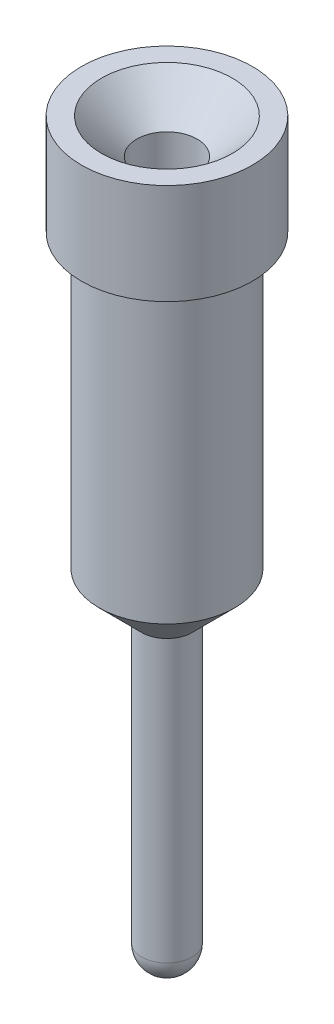
ISO-10303-21;
HEADER;
FILE_DESCRIPTION(('STEP AP214'),'2;1');
FILE_NAME('part.step','',(''),(''),'','','');
FILE_SCHEMA(('AUTOMOTIVE_DESIGN { 1 0 10303 214 1 1 1 1 }'));
ENDSEC;
DATA;
#1=APPLICATION_CONTEXT('core data for automotive mechanical design processes');
#2=APPLICATION_PROTOCOL_DEFINITION('international standard','automotive_design',2000,#1);
#3=PRODUCT_CONTEXT('',#1,'mechanical');
#4=PRODUCT('Part','Part','',(#3));
#5=PRODUCT_RELATED_PRODUCT_CATEGORY('part','',(#4));
#6=PRODUCT_DEFINITION_FORMATION('','',#4);
#7=PRODUCT_DEFINITION_CONTEXT('part definition',#1,'design');
#8=PRODUCT_DEFINITION('design','',#6,#7);
#9=PRODUCT_DEFINITION_SHAPE('','',#8);
#10=(LENGTH_UNIT() NAMED_UNIT(*) SI_UNIT(.MILLI.,.METRE.));
#11=(NAMED_UNIT(*) PLANE_ANGLE_UNIT() SI_UNIT($,.RADIAN.));
#12=(NAMED_UNIT(*) SI_UNIT($,.STERADIAN.) SOLID_ANGLE_UNIT());
#13=UNCERTAINTY_MEASURE_WITH_UNIT(LENGTH_MEASURE(1.E-05),#10,'distance_accuracy_value','');
#14=(GEOMETRIC_REPRESENTATION_CONTEXT(3) GLOBAL_UNCERTAINTY_ASSIGNED_CONTEXT((#13)) GLOBAL_UNIT_ASSIGNED_CONTEXT((#10,
#11,#12)) REPRESENTATION_CONTEXT('',''));
#15=CARTESIAN_POINT('',(0.,0.,0.));
#16=DIRECTION('',(0.,0.,1.));
#17=DIRECTION('',(1.,0.,0.));
#18=AXIS2_PLACEMENT_3D('',#15,#16,#17);
#19=CARTESIAN_POINT('',(-0.849999999999997,0.,0.));
#20=DIRECTION('',(0.,1.,0.));
#21=DIRECTION('',(0.,0.,1.));
#22=AXIS2_PLACEMENT_3D('',#19,#20,#21);
#23=PLANE('',#22);
#24=CARTESIAN_POINT('',(0.,0.,0.));
#25=DIRECTION('',(0.,1.,0.));
#26=DIRECTION('',(0.,0.,1.));
#27=AXIS2_PLACEMENT_3D('',#24,#25,#26);
#28=CIRCLE('',#27,0.849999999999997);
#29=CARTESIAN_POINT('',(0.,0.,0.849999999999997));
#30=VERTEX_POINT('',#29);
#31=EDGE_CURVE('E11',#30,#30,#28,.T.);
#32=ORIENTED_EDGE('',*,*,#31,.T.);
#33=EDGE_LOOP('',(#32));
#34=FACE_BOUND('',#33,.T.);
#35=CARTESIAN_POINT('',(0.,0.,0.));
#36=DIRECTION('',(0.,1.,0.));
#37=DIRECTION('',(0.,0.,1.));
#38=AXIS2_PLACEMENT_3D('',#35,#36,#37);
#39=CIRCLE('',#38,0.649999999999995);
#40=CARTESIAN_POINT('',(0.,0.,0.649999999999995));
#41=VERTEX_POINT('',#40);
#42=EDGE_CURVE('E75',#41,#41,#39,.T.);
#43=ORIENTED_EDGE('',*,*,#42,.F.);
#44=EDGE_LOOP('',(#43));
#45=FACE_BOUND('',#44,.T.);
#46=ADVANCED_FACE('F36',(#34,#45),#23,.T.);
#47=CARTESIAN_POINT('',(0.,28.992562867327,0.));
#48=DIRECTION('',(0.,1.,0.));
#49=DIRECTION('',(0.,0.,1.));
#50=AXIS2_PLACEMENT_3D('',#47,#48,#49);
#51=CYLINDRICAL_SURFACE('',#50,0.849999999999996);
#52=CARTESIAN_POINT('',(0.,-1.,0.));
#53=DIRECTION('',(0.,1.,0.));
#54=DIRECTION('',(0.,0.,1.));
#55=AXIS2_PLACEMENT_3D('',#52,#53,#54);
#56=CIRCLE('',#55,0.849999999999996);
#57=CARTESIAN_POINT('',(0.,-1.,0.849999999999996));
#58=VERTEX_POINT('',#57);
#59=EDGE_CURVE('E43',#58,#58,#56,.T.);
#60=ORIENTED_EDGE('',*,*,#59,.T.);
#61=EDGE_LOOP('',(#60));
#62=FACE_BOUND('',#61,.T.);
#63=ORIENTED_EDGE('',*,*,#31,.F.);
#64=EDGE_LOOP('',(#63));
#65=FACE_BOUND('',#64,.T.);
#66=ADVANCED_FACE('F64',(#62,#65),#51,.T.);
#67=CARTESIAN_POINT('',(-0.849999999999996,-0.999999999999999,0.));
#68=DIRECTION('',(0.,-1.,0.));
#69=DIRECTION('',(0.,0.,-1.));
#70=AXIS2_PLACEMENT_3D('',#67,#68,#69);
#71=PLANE('',#70);
#72=CARTESIAN_POINT('',(0.,-1.,0.));
#73=DIRECTION('',(0.,1.,0.));
#74=DIRECTION('',(0.,0.,1.));
#75=AXIS2_PLACEMENT_3D('',#72,#73,#74);
#76=CIRCLE('',#75,0.674999999999996);
#77=CARTESIAN_POINT('',(0.,-1.,0.674999999999996));
#78=VERTEX_POINT('',#77);
#79=EDGE_CURVE('E97',#78,#78,#76,.T.);
#80=ORIENTED_EDGE('',*,*,#79,.T.);
#81=EDGE_LOOP('',(#80));
#82=FACE_BOUND('',#81,.T.);
#83=ORIENTED_EDGE('',*,*,#59,.F.);
#84=EDGE_LOOP('',(#83));
#85=FACE_BOUND('',#84,.T.);
#86=ADVANCED_FACE('F69',(#82,#85),#71,.T.);
#87=CARTESIAN_POINT('',(0.,28.992562867327,0.));
#88=DIRECTION('',(0.,1.,0.));
#89=DIRECTION('',(0.,0.,1.));
#90=AXIS2_PLACEMENT_3D('',#87,#88,#89);
#91=CYLINDRICAL_SURFACE('',#90,0.674999999999996);
#92=CARTESIAN_POINT('',(0.,-3.9,0.));
#93=DIRECTION('',(0.,1.,0.));
#94=DIRECTION('',(0.,0.,1.));
#95=AXIS2_PLACEMENT_3D('',#92,#93,#94);
#96=CIRCLE('',#95,0.674999999999995);
#97=CARTESIAN_POINT('',(0.,-3.9,0.674999999999995));
#98=VERTEX_POINT('',#97);
#99=EDGE_CURVE('E94',#98,#98,#96,.T.);
#100=ORIENTED_EDGE('',*,*,#99,.T.);
#101=EDGE_LOOP('',(#100));
#102=FACE_BOUND('',#101,.T.);
#103=ORIENTED_EDGE('',*,*,#79,.F.);
#104=EDGE_LOOP('',(#103));
#105=FACE_BOUND('',#104,.T.);
#106=ADVANCED_FACE('F106',(#102,#105),#91,.T.);
#107=CARTESIAN_POINT('',(0.,-3.9,0.));
#108=DIRECTION('',(0.,1.,0.));
#109=DIRECTION('',(0.,0.,1.));
#110=AXIS2_PLACEMENT_3D('',#107,#108,#109);
#111=CONICAL_SURFACE('',#110,0.674999999999995,0.785398163397453);
#112=CARTESIAN_POINT('',(0.,-4.325,0.));
#113=DIRECTION('',(0.,1.,0.));
#114=DIRECTION('',(0.,0.,1.));
#115=AXIS2_PLACEMENT_3D('',#112,#113,#114);
#116=CIRCLE('',#115,0.249999999999996);
#117=CARTESIAN_POINT('',(0.,-4.325,0.249999999999996));
#118=VERTEX_POINT('',#117);
#119=EDGE_CURVE('E91',#118,#118,#116,.T.);
#120=ORIENTED_EDGE('',*,*,#119,.T.);
#121=EDGE_LOOP('',(#120));
#122=FACE_BOUND('',#121,.T.);
#123=ORIENTED_EDGE('',*,*,#99,.F.);
#124=EDGE_LOOP('',(#123));
#125=FACE_BOUND('',#124,.T.);
#126=ADVANCED_FACE('F112',(#122,#125),#111,.T.);
#127=CARTESIAN_POINT('',(0.,28.992562867327,0.));
#128=DIRECTION('',(0.,1.,0.));
#129=DIRECTION('',(0.,0.,1.));
#130=AXIS2_PLACEMENT_3D('',#127,#128,#129);
#131=CYLINDRICAL_SURFACE('',#130,0.249999999999996);
#132=CARTESIAN_POINT('',(0.,-7.12,0.));
#133=DIRECTION('',(0.,1.,0.));
#134=DIRECTION('',(0.,0.,1.));
#135=AXIS2_PLACEMENT_3D('',#132,#133,#134);
#136=CIRCLE('',#135,0.249999999999996);
#137=CARTESIAN_POINT('',(0.,-7.12,0.249999999999996));
#138=VERTEX_POINT('',#137);
#139=EDGE_CURVE('E88',#138,#138,#136,.T.);
#140=ORIENTED_EDGE('',*,*,#139,.T.);
#141=EDGE_LOOP('',(#140));
#142=FACE_BOUND('',#141,.T.);
#143=ORIENTED_EDGE('',*,*,#119,.F.);
#144=EDGE_LOOP('',(#143));
#145=FACE_BOUND('',#144,.T.);
#146=ADVANCED_FACE('F59',(#142,#145),#131,.T.);
#147=CARTESIAN_POINT('',(0.,-7.12,0.));
#148=DIRECTION('',(0.,1.,0.));
#149=DIRECTION('',(-1.,0.,0.));
#150=AXIS2_PLACEMENT_3D('',#147,#148,#149);
#151=SPHERICAL_SURFACE('',#150,0.249999999999996);
#152=ORIENTED_EDGE('',*,*,#139,.F.);
#153=EDGE_LOOP('',(#152));
#154=FACE_BOUND('',#153,.T.);
#155=ADVANCED_FACE('F49',(#154),#151,.T.);
#156=CARTESIAN_POINT('',(0.,-4.,0.));
#157=DIRECTION('',(0.,1.,0.));
#158=DIRECTION('',(0.,0.,1.));
#159=AXIS2_PLACEMENT_3D('',#156,#157,#158);
#160=CONICAL_SURFACE('',#159,0.,0.785398163397442);
#161=CARTESIAN_POINT('',(0.,-3.7,0.));
#162=DIRECTION('',(0.,1.,0.));
#163=DIRECTION('',(0.,0.,1.));
#164=AXIS2_PLACEMENT_3D('',#161,#162,#163);
#165=CIRCLE('',#164,0.299999999999995);
#166=CARTESIAN_POINT('',(0.,-3.7,0.299999999999995));
#167=VERTEX_POINT('',#166);
#168=EDGE_CURVE('E84',#167,#167,#165,.T.);
#169=ORIENTED_EDGE('',*,*,#168,.T.);
#170=EDGE_LOOP('',(#169));
#171=FACE_BOUND('',#170,.T.);
#172=CARTESIAN_POINT('',(0.,-4.,0.));
#173=VERTEX_POINT('',#172);
#174=VERTEX_LOOP('',#173);
#175=FACE_BOUND('',#174,.T.);
#176=ADVANCED_FACE('F46',(#171,#175),#160,.F.);
#177=CARTESIAN_POINT('',(0.,28.992562867327,0.));
#178=DIRECTION('',(0.,1.,0.));
#179=DIRECTION('',(0.,0.,1.));
#180=AXIS2_PLACEMENT_3D('',#177,#178,#179);
#181=CYLINDRICAL_SURFACE('',#180,0.299999999999996);
#182=CARTESIAN_POINT('',(0.,-0.35,0.));
#183=DIRECTION('',(0.,1.,0.));
#184=DIRECTION('',(0.,0.,1.));
#185=AXIS2_PLACEMENT_3D('',#182,#183,#184);
#186=CIRCLE('',#185,0.299999999999996);
#187=CARTESIAN_POINT('',(0.,-0.35,0.299999999999996));
#188=VERTEX_POINT('',#187);
#189=EDGE_CURVE('E78',#188,#188,#186,.T.);
#190=ORIENTED_EDGE('',*,*,#189,.T.);
#191=EDGE_LOOP('',(#190));
#192=FACE_BOUND('',#191,.T.);
#193=ORIENTED_EDGE('',*,*,#168,.F.);
#194=EDGE_LOOP('',(#193));
#195=FACE_BOUND('',#194,.T.);
#196=ADVANCED_FACE('F48',(#192,#195),#181,.F.);
#197=CARTESIAN_POINT('',(0.,-0.35,0.));
#198=DIRECTION('',(0.,1.,0.));
#199=DIRECTION('',(0.,0.,1.));
#200=AXIS2_PLACEMENT_3D('',#197,#198,#199);
#201=CONICAL_SURFACE('',#200,0.299999999999996,0.785398163397447);
#202=ORIENTED_EDGE('',*,*,#42,.T.);
#203=EDGE_LOOP('',(#202));
#204=FACE_BOUND('',#203,.T.);
#205=ORIENTED_EDGE('',*,*,#189,.F.);
#206=EDGE_LOOP('',(#205));
#207=FACE_BOUND('',#206,.T.);
#208=ADVANCED_FACE('F56',(#204,#207),#201,.F.);
#209=CLOSED_SHELL('',(#46,#66,#86,#106,#126,#146,#155,#176,#196,#208));
#210=MANIFOLD_SOLID_BREP('B2',#209);
#211=ADVANCED_BREP_SHAPE_REPRESENTATION('',(#18,#210),#14);
#212=SHAPE_DEFINITION_REPRESENTATION(#9,#211);
ENDSEC;
END-ISO-10303-21;
